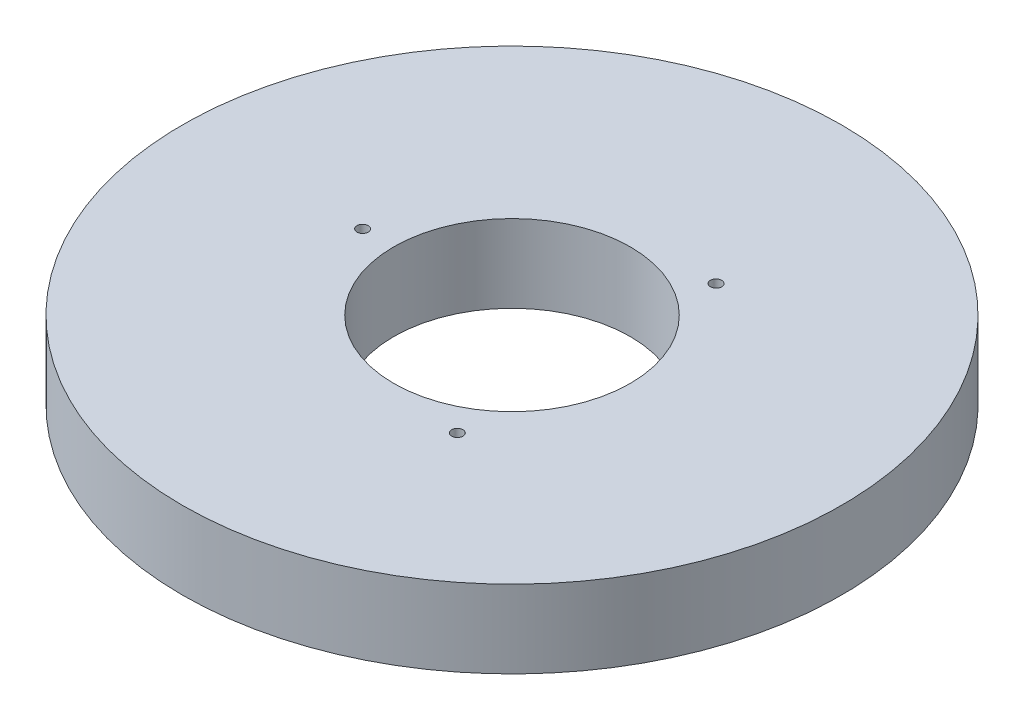
ISO-10303-21;
HEADER;
FILE_DESCRIPTION(('STEP AP214'),'2;1');
FILE_NAME('part.step','',(''),(''),'','','');
FILE_SCHEMA(('AUTOMOTIVE_DESIGN { 1 0 10303 214 1 1 1 1 }'));
ENDSEC;
DATA;
#1=APPLICATION_CONTEXT('core data for automotive mechanical design processes');
#2=APPLICATION_PROTOCOL_DEFINITION('international standard','automotive_design',2000,#1);
#3=PRODUCT_CONTEXT('',#1,'mechanical');
#4=PRODUCT('Part','Part','',(#3));
#5=PRODUCT_RELATED_PRODUCT_CATEGORY('part','',(#4));
#6=PRODUCT_DEFINITION_FORMATION('','',#4);
#7=PRODUCT_DEFINITION_CONTEXT('part definition',#1,'design');
#8=PRODUCT_DEFINITION('design','',#6,#7);
#9=PRODUCT_DEFINITION_SHAPE('','',#8);
#10=(LENGTH_UNIT() NAMED_UNIT(*) SI_UNIT(.MILLI.,.METRE.));
#11=(NAMED_UNIT(*) PLANE_ANGLE_UNIT() SI_UNIT($,.RADIAN.));
#12=(NAMED_UNIT(*) SI_UNIT($,.STERADIAN.) SOLID_ANGLE_UNIT());
#13=UNCERTAINTY_MEASURE_WITH_UNIT(LENGTH_MEASURE(1.E-05),#10,'distance_accuracy_value','');
#14=(GEOMETRIC_REPRESENTATION_CONTEXT(3) GLOBAL_UNCERTAINTY_ASSIGNED_CONTEXT((#13)) GLOBAL_UNIT_ASSIGNED_CONTEXT((#10,
#11,#12)) REPRESENTATION_CONTEXT('',''));
#15=CARTESIAN_POINT('',(0.,0.,0.));
#16=DIRECTION('',(0.,0.,1.));
#17=DIRECTION('',(1.,0.,0.));
#18=AXIS2_PLACEMENT_3D('',#15,#16,#17);
#19=CARTESIAN_POINT('',(0.,23.,0.));
#20=DIRECTION('',(0.,-1.,0.));
#21=DIRECTION('',(0.,0.,-1.));
#22=AXIS2_PLACEMENT_3D('',#19,#20,#21);
#23=CYLINDRICAL_SURFACE('',#22,97.5);
#24=CARTESIAN_POINT('',(0.,23.,0.));
#25=DIRECTION('',(0.,1.,0.));
#26=DIRECTION('',(0.,0.,1.));
#27=AXIS2_PLACEMENT_3D('',#24,#25,#26);
#28=CIRCLE('',#27,97.5);
#29=CARTESIAN_POINT('',(0.,23.,97.5));
#30=VERTEX_POINT('',#29);
#31=EDGE_CURVE('E10',#30,#30,#28,.T.);
#32=ORIENTED_EDGE('',*,*,#31,.F.);
#33=EDGE_LOOP('',(#32));
#34=FACE_BOUND('',#33,.T.);
#35=CARTESIAN_POINT('',(0.,0.,0.));
#36=DIRECTION('',(0.,1.,0.));
#37=DIRECTION('',(0.,0.,1.));
#38=AXIS2_PLACEMENT_3D('',#35,#36,#37);
#39=CIRCLE('',#38,97.5);
#40=CARTESIAN_POINT('',(0.,0.,97.5));
#41=VERTEX_POINT('',#40);
#42=EDGE_CURVE('E37',#41,#41,#39,.T.);
#43=ORIENTED_EDGE('',*,*,#42,.T.);
#44=EDGE_LOOP('',(#43));
#45=FACE_BOUND('',#44,.T.);
#46=ADVANCED_FACE('F40',(#34,#45),#23,.T.);
#47=CARTESIAN_POINT('',(0.,23.,0.));
#48=DIRECTION('',(0.,1.,0.));
#49=DIRECTION('',(0.,0.,1.));
#50=AXIS2_PLACEMENT_3D('',#47,#48,#49);
#51=PLANE('',#50);
#52=CARTESIAN_POINT('',(22.0979257461077,23.,38.2747301341424));
#53=DIRECTION('',(0.,1.,0.));
#54=DIRECTION('',(0.866025403784436,0.,-0.500000000000004));
#55=AXIS2_PLACEMENT_3D('',#52,#53,#54);
#56=CIRCLE('',#55,1.66837624515605);
#57=CARTESIAN_POINT('',(23.5427819574833,23.,37.4405420115644));
#58=VERTEX_POINT('',#57);
#59=EDGE_CURVE('E70',#58,#58,#56,.T.);
#60=ORIENTED_EDGE('',*,*,#59,.F.);
#61=EDGE_LOOP('',(#60));
#62=FACE_BOUND('',#61,.T.);
#63=CARTESIAN_POINT('',(22.0979257461071,23.,-38.2747301341427));
#64=DIRECTION('',(0.,1.,0.));
#65=DIRECTION('',(-0.866025403784443,0.,-0.499999999999992));
#66=AXIS2_PLACEMENT_3D('',#63,#64,#65);
#67=CIRCLE('',#66,1.66837624515605);
#68=CARTESIAN_POINT('',(20.6530695347315,23.,-39.1089182567207));
#69=VERTEX_POINT('',#68);
#70=EDGE_CURVE('E61',#69,#69,#67,.T.);
#71=ORIENTED_EDGE('',*,*,#70,.F.);
#72=EDGE_LOOP('',(#71));
#73=FACE_BOUND('',#72,.T.);
#74=CARTESIAN_POINT('',(-44.1958514922149,23.,0.));
#75=DIRECTION('',(0.,1.,0.));
#76=DIRECTION('',(0.,0.,1.));
#77=AXIS2_PLACEMENT_3D('',#74,#75,#76);
#78=CIRCLE('',#77,1.66837624515605);
#79=CARTESIAN_POINT('',(-44.1958514922149,23.,1.66837624515605));
#80=VERTEX_POINT('',#79);
#81=EDGE_CURVE('E54',#80,#80,#78,.T.);
#82=ORIENTED_EDGE('',*,*,#81,.F.);
#83=EDGE_LOOP('',(#82));
#84=FACE_BOUND('',#83,.T.);
#85=CARTESIAN_POINT('',(0.,23.,0.));
#86=DIRECTION('',(0.,1.,0.));
#87=DIRECTION('',(0.,0.,1.));
#88=AXIS2_PLACEMENT_3D('',#85,#86,#87);
#89=CIRCLE('',#88,35.);
#90=CARTESIAN_POINT('',(0.,23.,35.));
#91=VERTEX_POINT('',#90);
#92=EDGE_CURVE('E50',#91,#91,#89,.T.);
#93=ORIENTED_EDGE('',*,*,#92,.F.);
#94=EDGE_LOOP('',(#93));
#95=FACE_BOUND('',#94,.T.);
#96=ORIENTED_EDGE('',*,*,#31,.T.);
#97=EDGE_LOOP('',(#96));
#98=FACE_BOUND('',#97,.T.);
#99=ADVANCED_FACE('F85',(#62,#73,#84,#95,#98),#51,.T.);
#100=CARTESIAN_POINT('',(0.,0.,0.));
#101=DIRECTION('',(0.,1.,0.));
#102=DIRECTION('',(0.,0.,1.));
#103=AXIS2_PLACEMENT_3D('',#100,#101,#102);
#104=PLANE('',#103);
#105=CARTESIAN_POINT('',(0.,0.,0.));
#106=DIRECTION('',(0.,1.,0.));
#107=DIRECTION('',(0.,0.,1.));
#108=AXIS2_PLACEMENT_3D('',#105,#106,#107);
#109=CIRCLE('',#108,35.);
#110=CARTESIAN_POINT('',(0.,0.,35.));
#111=VERTEX_POINT('',#110);
#112=EDGE_CURVE('E47',#111,#111,#109,.T.);
#113=ORIENTED_EDGE('',*,*,#112,.T.);
#114=EDGE_LOOP('',(#113));
#115=FACE_BOUND('',#114,.T.);
#116=ORIENTED_EDGE('',*,*,#42,.F.);
#117=EDGE_LOOP('',(#116));
#118=FACE_BOUND('',#117,.T.);
#119=ADVANCED_FACE('F84',(#115,#118),#104,.F.);
#120=CARTESIAN_POINT('',(0.,23.,0.));
#121=DIRECTION('',(0.,-1.,0.));
#122=DIRECTION('',(0.,0.,-1.));
#123=AXIS2_PLACEMENT_3D('',#120,#121,#122);
#124=CYLINDRICAL_SURFACE('',#123,35.);
#125=ORIENTED_EDGE('',*,*,#92,.T.);
#126=EDGE_LOOP('',(#125));
#127=FACE_BOUND('',#126,.T.);
#128=ORIENTED_EDGE('',*,*,#112,.F.);
#129=EDGE_LOOP('',(#128));
#130=FACE_BOUND('',#129,.T.);
#131=ADVANCED_FACE('F91',(#127,#130),#124,.F.);
#132=CARTESIAN_POINT('',(-44.1958514922149,1.02866790197894,0.));
#133=DIRECTION('',(0.,1.,0.));
#134=DIRECTION('',(0.,0.,1.));
#135=AXIS2_PLACEMENT_3D('',#132,#133,#134);
#136=CYLINDRICAL_SURFACE('',#135,1.66837624515605);
#137=CARTESIAN_POINT('',(-44.1958514922149,1.02866790197894,0.));
#138=DIRECTION('',(0.,1.,0.));
#139=DIRECTION('',(0.,0.,1.));
#140=AXIS2_PLACEMENT_3D('',#137,#138,#139);
#141=CIRCLE('',#140,1.66837624515605);
#142=CARTESIAN_POINT('',(-44.1958514922149,1.02866790197894,1.66837624515605));
#143=VERTEX_POINT('',#142);
#144=EDGE_CURVE('E55',#143,#143,#141,.T.);
#145=ORIENTED_EDGE('',*,*,#144,.F.);
#146=EDGE_LOOP('',(#145));
#147=FACE_BOUND('',#146,.T.);
#148=ORIENTED_EDGE('',*,*,#81,.T.);
#149=EDGE_LOOP('',(#148));
#150=FACE_BOUND('',#149,.T.);
#151=ADVANCED_FACE('F96',(#147,#150),#136,.F.);
#152=CARTESIAN_POINT('',(-44.1958514922149,1.02866790197894,0.));
#153=DIRECTION('',(0.,1.,0.));
#154=DIRECTION('',(0.,0.,1.));
#155=AXIS2_PLACEMENT_3D('',#152,#153,#154);
#156=PLANE('',#155);
#157=ORIENTED_EDGE('',*,*,#144,.T.);
#158=EDGE_LOOP('',(#157));
#159=FACE_BOUND('',#158,.T.);
#160=ADVANCED_FACE('F127',(#159),#156,.T.);
#161=CARTESIAN_POINT('',(22.0979257461071,1.02866790197894,-38.2747301341427));
#162=DIRECTION('',(0.,1.,0.));
#163=DIRECTION('',(0.,0.,1.));
#164=AXIS2_PLACEMENT_3D('',#161,#162,#163);
#165=CYLINDRICAL_SURFACE('',#164,1.66837624515605);
#166=CARTESIAN_POINT('',(22.0979257461071,1.02866790197894,-38.2747301341427));
#167=DIRECTION('',(0.,1.,0.));
#168=DIRECTION('',(-0.866025403784443,0.,-0.499999999999992));
#169=AXIS2_PLACEMENT_3D('',#166,#167,#168);
#170=CIRCLE('',#169,1.66837624515605);
#171=CARTESIAN_POINT('',(20.6530695347315,1.02866790197894,-39.1089182567207));
#172=VERTEX_POINT('',#171);
#173=EDGE_CURVE('E63',#172,#172,#170,.T.);
#174=ORIENTED_EDGE('',*,*,#173,.F.);
#175=EDGE_LOOP('',(#174));
#176=FACE_BOUND('',#175,.T.);
#177=ORIENTED_EDGE('',*,*,#70,.T.);
#178=EDGE_LOOP('',(#177));
#179=FACE_BOUND('',#178,.T.);
#180=ADVANCED_FACE('F133',(#176,#179),#165,.F.);
#181=CARTESIAN_POINT('',(22.0979257461071,1.02866790197894,-38.2747301341427));
#182=DIRECTION('',(0.,1.,0.));
#183=DIRECTION('',(-0.866025403784443,0.,-0.499999999999992));
#184=AXIS2_PLACEMENT_3D('',#181,#182,#183);
#185=PLANE('',#184);
#186=ORIENTED_EDGE('',*,*,#173,.T.);
#187=EDGE_LOOP('',(#186));
#188=FACE_BOUND('',#187,.T.);
#189=ADVANCED_FACE('F77',(#188),#185,.T.);
#190=CARTESIAN_POINT('',(22.0979257461077,1.02866790197894,38.2747301341424));
#191=DIRECTION('',(0.,1.,0.));
#192=DIRECTION('',(0.,0.,1.));
#193=AXIS2_PLACEMENT_3D('',#190,#191,#192);
#194=CYLINDRICAL_SURFACE('',#193,1.66837624515605);
#195=CARTESIAN_POINT('',(22.0979257461077,1.02866790197894,38.2747301341424));
#196=DIRECTION('',(0.,1.,0.));
#197=DIRECTION('',(0.866025403784436,0.,-0.500000000000004));
#198=AXIS2_PLACEMENT_3D('',#195,#196,#197);
#199=CIRCLE('',#198,1.66837624515605);
#200=CARTESIAN_POINT('',(23.5427819574833,1.02866790197894,37.4405420115644));
#201=VERTEX_POINT('',#200);
#202=EDGE_CURVE('E59',#201,#201,#199,.T.);
#203=ORIENTED_EDGE('',*,*,#202,.F.);
#204=EDGE_LOOP('',(#203));
#205=FACE_BOUND('',#204,.T.);
#206=ORIENTED_EDGE('',*,*,#59,.T.);
#207=EDGE_LOOP('',(#206));
#208=FACE_BOUND('',#207,.T.);
#209=ADVANCED_FACE('F73',(#205,#208),#194,.F.);
#210=CARTESIAN_POINT('',(22.0979257461077,1.02866790197894,38.2747301341424));
#211=DIRECTION('',(0.,1.,0.));
#212=DIRECTION('',(0.866025403784436,0.,-0.500000000000004));
#213=AXIS2_PLACEMENT_3D('',#210,#211,#212);
#214=PLANE('',#213);
#215=ORIENTED_EDGE('',*,*,#202,.T.);
#216=EDGE_LOOP('',(#215));
#217=FACE_BOUND('',#216,.T.);
#218=ADVANCED_FACE('F71',(#217),#214,.T.);
#219=CLOSED_SHELL('',(#46,#99,#119,#131,#151,#160,#180,#189,#209,#218));
#220=MANIFOLD_SOLID_BREP('B2',#219);
#221=ADVANCED_BREP_SHAPE_REPRESENTATION('',(#18,#220),#14);
#222=SHAPE_DEFINITION_REPRESENTATION(#9,#221);
ENDSEC;
END-ISO-10303-21;
